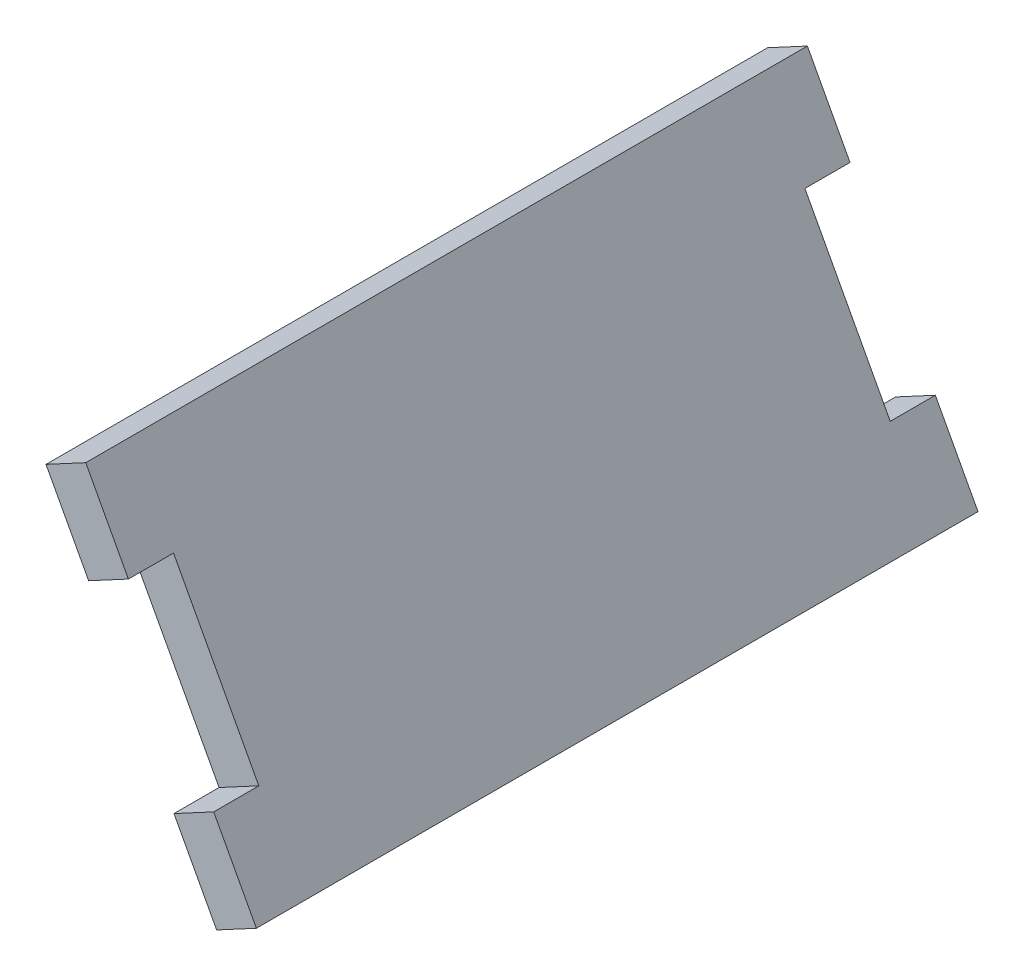
ISO-10303-21;
HEADER;
FILE_DESCRIPTION(('STEP AP214'),'2;1');
FILE_NAME('part.step','',(''),(''),'','','');
FILE_SCHEMA(('AUTOMOTIVE_DESIGN { 1 0 10303 214 1 1 1 1 }'));
ENDSEC;
DATA;
#1=APPLICATION_CONTEXT('core data for automotive mechanical design processes');
#2=APPLICATION_PROTOCOL_DEFINITION('international standard','automotive_design',2000,#1);
#3=PRODUCT_CONTEXT('',#1,'mechanical');
#4=PRODUCT('Part','Part','',(#3));
#5=PRODUCT_RELATED_PRODUCT_CATEGORY('part','',(#4));
#6=PRODUCT_DEFINITION_FORMATION('','',#4);
#7=PRODUCT_DEFINITION_CONTEXT('part definition',#1,'design');
#8=PRODUCT_DEFINITION('design','',#6,#7);
#9=PRODUCT_DEFINITION_SHAPE('','',#8);
#10=(LENGTH_UNIT() NAMED_UNIT(*) SI_UNIT(.MILLI.,.METRE.));
#11=(NAMED_UNIT(*) PLANE_ANGLE_UNIT() SI_UNIT($,.RADIAN.));
#12=(NAMED_UNIT(*) SI_UNIT($,.STERADIAN.) SOLID_ANGLE_UNIT());
#13=UNCERTAINTY_MEASURE_WITH_UNIT(LENGTH_MEASURE(1.E-05),#10,'distance_accuracy_value','');
#14=(GEOMETRIC_REPRESENTATION_CONTEXT(3) GLOBAL_UNCERTAINTY_ASSIGNED_CONTEXT((#13)) GLOBAL_UNIT_ASSIGNED_CONTEXT((#10,
#11,#12)) REPRESENTATION_CONTEXT('',''));
#15=CARTESIAN_POINT('',(0.,0.,0.));
#16=DIRECTION('',(0.,0.,1.));
#17=DIRECTION('',(1.,0.,0.));
#18=AXIS2_PLACEMENT_3D('',#15,#16,#17);
#19=CARTESIAN_POINT('',(0.,0.,-50.8));
#20=DIRECTION('',(0.,0.,-1.));
#21=DIRECTION('',(-1.,0.,0.));
#22=AXIS2_PLACEMENT_3D('',#19,#20,#21);
#23=PLANE('',#22);
#24=DIRECTION('',(0.881120200780153,0.472892368068192,0.));
#25=VECTOR('',#24,1.);
#26=CARTESIAN_POINT('',(149.714088642471,317.155673188776,-50.8));
#27=LINE('',#26,#25);
#28=CARTESIAN_POINT('',(149.714088642471,317.155673188776,-50.8));
#29=VERTEX_POINT('',#28);
#30=CARTESIAN_POINT('',(152.511645279948,318.657106457392,-50.8));
#31=VERTEX_POINT('',#30);
#32=EDGE_CURVE('E153',#29,#31,#27,.T.);
#33=ORIENTED_EDGE('',*,*,#32,.F.);
#34=DIRECTION('',(-0.472892368068192,0.881120200780153,0.));
#35=VECTOR('',#34,1.);
#36=CARTESIAN_POINT('',(158.72268825417,300.370333363914,-50.8));
#37=LINE('',#36,#35);
#38=CARTESIAN_POINT('',(146.711222105238,322.75078646373,-50.8));
#39=VERTEX_POINT('',#38);
#40=EDGE_CURVE('E190',#29,#39,#37,.T.);
#41=ORIENTED_EDGE('',*,*,#40,.T.);
#42=DIRECTION('',(0.881120200780153,0.472892368068192,0.));
#43=VECTOR('',#42,1.);
#44=CARTESIAN_POINT('',(146.711222105238,322.75078646373,-50.8));
#45=LINE('',#44,#43);
#46=CARTESIAN_POINT('',(149.508778742715,324.252219732346,-50.8));
#47=VERTEX_POINT('',#46);
#48=EDGE_CURVE('E180',#39,#47,#45,.T.);
#49=ORIENTED_EDGE('',*,*,#48,.T.);
#50=DIRECTION('',(0.472892368068192,-0.881120200780153,0.));
#51=VECTOR('',#50,1.);
#52=CARTESIAN_POINT('',(149.508778742715,324.252219732346,-50.8));
#53=LINE('',#52,#51);
#54=EDGE_CURVE('E185',#47,#31,#53,.T.);
#55=ORIENTED_EDGE('',*,*,#54,.T.);
#56=EDGE_LOOP('',(#33,#41,#49,#55));
#57=FACE_BOUND('',#56,.T.);
#58=ADVANCED_FACE('F33',(#57),#23,.T.);
#59=CARTESIAN_POINT('',(0.,0.,0.));
#60=DIRECTION('',(0.,0.,-1.));
#61=DIRECTION('',(-1.,0.,0.));
#62=AXIS2_PLACEMENT_3D('',#59,#60,#61);
#63=PLANE('',#62);
#64=DIRECTION('',(-0.472892368068192,0.881120200780153,0.));
#65=VECTOR('',#64,1.);
#66=CARTESIAN_POINT('',(158.72268825417,300.370333363914,0.));
#67=LINE('',#66,#65);
#68=CARTESIAN_POINT('',(149.714088642471,317.155673188776,0.));
#69=VERTEX_POINT('',#68);
#70=CARTESIAN_POINT('',(146.711222105238,322.75078646373,0.));
#71=VERTEX_POINT('',#70);
#72=EDGE_CURVE('E202',#69,#71,#67,.T.);
#73=ORIENTED_EDGE('',*,*,#72,.F.);
#74=DIRECTION('',(0.881120200780153,0.472892368068192,0.));
#75=VECTOR('',#74,1.);
#76=CARTESIAN_POINT('',(149.714088642471,317.155673188776,0.));
#77=LINE('',#76,#75);
#78=CARTESIAN_POINT('',(152.511645279948,318.657106457392,0.));
#79=VERTEX_POINT('',#78);
#80=EDGE_CURVE('E171',#69,#79,#77,.T.);
#81=ORIENTED_EDGE('',*,*,#80,.T.);
#82=DIRECTION('',(0.472892368068192,-0.881120200780153,0.));
#83=VECTOR('',#82,1.);
#84=CARTESIAN_POINT('',(149.508778742715,324.252219732346,0.));
#85=LINE('',#84,#83);
#86=CARTESIAN_POINT('',(149.508778742715,324.252219732346,0.));
#87=VERTEX_POINT('',#86);
#88=EDGE_CURVE('E197',#87,#79,#85,.T.);
#89=ORIENTED_EDGE('',*,*,#88,.F.);
#90=DIRECTION('',(0.881120200780153,0.472892368068192,0.));
#91=VECTOR('',#90,1.);
#92=CARTESIAN_POINT('',(146.711222105238,322.75078646373,0.));
#93=LINE('',#92,#91);
#94=EDGE_CURVE('E174',#71,#87,#93,.T.);
#95=ORIENTED_EDGE('',*,*,#94,.F.);
#96=EDGE_LOOP('',(#73,#81,#89,#95));
#97=FACE_BOUND('',#96,.T.);
#98=ADVANCED_FACE('F238',(#97),#63,.F.);
#99=CARTESIAN_POINT('',(146.711222105238,322.75078646373,-50.8));
#100=DIRECTION('',(0.472892368068192,-0.881120200780153,0.));
#101=DIRECTION('',(0.881120200780153,0.472892368068192,0.));
#102=AXIS2_PLACEMENT_3D('',#99,#100,#101);
#103=PLANE('',#102);
#104=ORIENTED_EDGE('',*,*,#94,.T.);
#105=DIRECTION('',(0.,0.,1.));
#106=VECTOR('',#105,1.);
#107=CARTESIAN_POINT('',(149.508778742715,324.252219732346,-50.8));
#108=LINE('',#107,#106);
#109=EDGE_CURVE('E11',#47,#87,#108,.T.);
#110=ORIENTED_EDGE('',*,*,#109,.F.);
#111=ORIENTED_EDGE('',*,*,#48,.F.);
#112=DIRECTION('',(0.,0.,1.));
#113=VECTOR('',#112,1.);
#114=CARTESIAN_POINT('',(146.711222105238,322.75078646373,-50.8));
#115=LINE('',#114,#113);
#116=EDGE_CURVE('E193',#39,#71,#115,.T.);
#117=ORIENTED_EDGE('',*,*,#116,.T.);
#118=EDGE_LOOP('',(#104,#110,#111,#117));
#119=FACE_BOUND('',#118,.T.);
#120=ADVANCED_FACE('F35',(#119),#103,.F.);
#121=CARTESIAN_POINT('',(149.508778742715,324.252219732346,-50.8));
#122=DIRECTION('',(-0.881120200780153,-0.472892368068192,0.));
#123=DIRECTION('',(0.472892368068192,-0.881120200780153,0.));
#124=AXIS2_PLACEMENT_3D('',#121,#122,#123);
#125=PLANE('',#124);
#126=DIRECTION('',(0.472892368068192,-0.881120200780153,0.));
#127=VECTOR('',#126,1.);
#128=CARTESIAN_POINT('',(158.517378354414,307.466879907484,-47.625));
#129=LINE('',#128,#127);
#130=CARTESIAN_POINT('',(152.511645279948,318.657106457392,-47.625));
#131=VERTEX_POINT('',#130);
#132=CARTESIAN_POINT('',(158.517378354414,307.466879907484,-47.625));
#133=VERTEX_POINT('',#132);
#134=EDGE_CURVE('E129',#131,#133,#129,.T.);
#135=ORIENTED_EDGE('',*,*,#134,.F.);
#136=DIRECTION('',(0.,0.,1.));
#137=VECTOR('',#136,1.);
#138=CARTESIAN_POINT('',(152.511645279948,318.657106457392,-47.625));
#139=LINE('',#138,#137);
#140=EDGE_CURVE('E142',#31,#131,#139,.T.);
#141=ORIENTED_EDGE('',*,*,#140,.F.);
#142=ORIENTED_EDGE('',*,*,#54,.F.);
#143=ORIENTED_EDGE('',*,*,#109,.T.);
#144=ORIENTED_EDGE('',*,*,#88,.T.);
#145=DIRECTION('',(0.,0.,1.));
#146=VECTOR('',#145,1.);
#147=CARTESIAN_POINT('',(152.511645279948,318.657106457392,0.));
#148=LINE('',#147,#146);
#149=CARTESIAN_POINT('',(152.511645279948,318.657106457392,-3.17499999999998));
#150=VERTEX_POINT('',#149);
#151=EDGE_CURVE('E158',#150,#79,#148,.T.);
#152=ORIENTED_EDGE('',*,*,#151,.F.);
#153=DIRECTION('',(-0.472892368068192,0.881120200780153,0.));
#154=VECTOR('',#153,1.);
#155=CARTESIAN_POINT('',(152.511645279948,318.657106457392,-3.17499999999998));
#156=LINE('',#155,#154);
#157=CARTESIAN_POINT('',(158.517378354414,307.466879907484,-3.17499999999998));
#158=VERTEX_POINT('',#157);
#159=EDGE_CURVE('E167',#158,#150,#156,.T.);
#160=ORIENTED_EDGE('',*,*,#159,.F.);
#161=DIRECTION('',(0.,0.,-1.));
#162=VECTOR('',#161,1.);
#163=CARTESIAN_POINT('',(158.517378354414,307.466879907484,0.));
#164=LINE('',#163,#162);
#165=CARTESIAN_POINT('',(158.517378354414,307.466879907484,0.));
#166=VERTEX_POINT('',#165);
#167=EDGE_CURVE('E152',#166,#158,#164,.T.);
#168=ORIENTED_EDGE('',*,*,#167,.F.);
#169=CARTESIAN_POINT('',(161.520244891647,301.87176663253,0.));
#170=VERTEX_POINT('',#169);
#171=EDGE_CURVE('E196',#166,#170,#85,.T.);
#172=ORIENTED_EDGE('',*,*,#171,.T.);
#173=DIRECTION('',(0.,0.,1.));
#174=VECTOR('',#173,1.);
#175=CARTESIAN_POINT('',(161.520244891647,301.87176663253,-50.8));
#176=LINE('',#175,#174);
#177=CARTESIAN_POINT('',(161.520244891647,301.87176663253,-50.8));
#178=VERTEX_POINT('',#177);
#179=EDGE_CURVE('E41',#178,#170,#176,.T.);
#180=ORIENTED_EDGE('',*,*,#179,.F.);
#181=CARTESIAN_POINT('',(158.517378354414,307.466879907484,-50.8));
#182=VERTEX_POINT('',#181);
#183=EDGE_CURVE('E183',#182,#178,#53,.T.);
#184=ORIENTED_EDGE('',*,*,#183,.F.);
#185=DIRECTION('',(0.,0.,-1.));
#186=VECTOR('',#185,1.);
#187=CARTESIAN_POINT('',(158.517378354414,307.466879907484,-47.625));
#188=LINE('',#187,#186);
#189=EDGE_CURVE('E48',#133,#182,#188,.T.);
#190=ORIENTED_EDGE('',*,*,#189,.F.);
#191=EDGE_LOOP('',(#135,#141,#142,#143,#144,#152,#160,#168,#172,#180,#184,#190));
#192=FACE_BOUND('',#191,.T.);
#193=ADVANCED_FACE('F224',(#192),#125,.F.);
#194=CARTESIAN_POINT('',(161.520244891647,301.87176663253,-50.8));
#195=DIRECTION('',(-0.472892368068175,0.881120200780163,0.));
#196=DIRECTION('',(-0.881120200780163,-0.472892368068175,0.));
#197=AXIS2_PLACEMENT_3D('',#194,#195,#196);
#198=PLANE('',#197);
#199=DIRECTION('',(-0.881120200780162,-0.472892368068175,0.));
#200=VECTOR('',#199,1.);
#201=CARTESIAN_POINT('',(161.520244891647,301.87176663253,0.));
#202=LINE('',#201,#200);
#203=CARTESIAN_POINT('',(158.72268825417,300.370333363914,0.));
#204=VERTEX_POINT('',#203);
#205=EDGE_CURVE('E200',#170,#204,#202,.T.);
#206=ORIENTED_EDGE('',*,*,#205,.T.);
#207=DIRECTION('',(0.,0.,1.));
#208=VECTOR('',#207,1.);
#209=CARTESIAN_POINT('',(158.72268825417,300.370333363914,-50.8));
#210=LINE('',#209,#208);
#211=CARTESIAN_POINT('',(158.72268825417,300.370333363914,-50.8));
#212=VERTEX_POINT('',#211);
#213=EDGE_CURVE('E207',#212,#204,#210,.T.);
#214=ORIENTED_EDGE('',*,*,#213,.F.);
#215=DIRECTION('',(-0.881120200780162,-0.472892368068175,0.));
#216=VECTOR('',#215,1.);
#217=CARTESIAN_POINT('',(161.520244891647,301.87176663253,-50.8));
#218=LINE('',#217,#216);
#219=EDGE_CURVE('E188',#178,#212,#218,.T.);
#220=ORIENTED_EDGE('',*,*,#219,.F.);
#221=ORIENTED_EDGE('',*,*,#179,.T.);
#222=EDGE_LOOP('',(#206,#214,#220,#221));
#223=FACE_BOUND('',#222,.T.);
#224=ADVANCED_FACE('F214',(#223),#198,.F.);
#225=CARTESIAN_POINT('',(158.72268825417,300.370333363914,-50.8));
#226=DIRECTION('',(0.881120200780153,0.472892368068192,0.));
#227=DIRECTION('',(-0.472892368068192,0.881120200780153,0.));
#228=AXIS2_PLACEMENT_3D('',#225,#226,#227);
#229=PLANE('',#228);
#230=ORIENTED_EDGE('',*,*,#40,.F.);
#231=DIRECTION('',(0.,0.,1.));
#232=VECTOR('',#231,1.);
#233=CARTESIAN_POINT('',(149.714088642471,317.155673188776,-47.625));
#234=LINE('',#233,#232);
#235=CARTESIAN_POINT('',(149.714088642471,317.155673188776,-47.625));
#236=VERTEX_POINT('',#235);
#237=EDGE_CURVE('E131',#29,#236,#234,.T.);
#238=ORIENTED_EDGE('',*,*,#237,.T.);
#239=DIRECTION('',(0.472892368068192,-0.881120200780153,0.));
#240=VECTOR('',#239,1.);
#241=CARTESIAN_POINT('',(155.719821716937,305.965446638868,-47.625));
#242=LINE('',#241,#240);
#243=CARTESIAN_POINT('',(155.719821716937,305.965446638868,-47.625));
#244=VERTEX_POINT('',#243);
#245=EDGE_CURVE('E126',#236,#244,#242,.T.);
#246=ORIENTED_EDGE('',*,*,#245,.T.);
#247=DIRECTION('',(0.,0.,-1.));
#248=VECTOR('',#247,1.);
#249=CARTESIAN_POINT('',(155.719821716937,305.965446638868,-47.625));
#250=LINE('',#249,#248);
#251=CARTESIAN_POINT('',(155.719821716937,305.965446638868,-50.8));
#252=VERTEX_POINT('',#251);
#253=EDGE_CURVE('E134',#244,#252,#250,.T.);
#254=ORIENTED_EDGE('',*,*,#253,.T.);
#255=EDGE_CURVE('E191',#212,#252,#37,.T.);
#256=ORIENTED_EDGE('',*,*,#255,.F.);
#257=ORIENTED_EDGE('',*,*,#213,.T.);
#258=CARTESIAN_POINT('',(155.719821716937,305.965446638868,0.));
#259=VERTEX_POINT('',#258);
#260=EDGE_CURVE('E184',#204,#259,#67,.T.);
#261=ORIENTED_EDGE('',*,*,#260,.T.);
#262=DIRECTION('',(0.,0.,-1.));
#263=VECTOR('',#262,1.);
#264=CARTESIAN_POINT('',(155.719821716937,305.965446638868,0.));
#265=LINE('',#264,#263);
#266=CARTESIAN_POINT('',(155.719821716937,305.965446638868,-3.17499999999998));
#267=VERTEX_POINT('',#266);
#268=EDGE_CURVE('E56',#259,#267,#265,.T.);
#269=ORIENTED_EDGE('',*,*,#268,.T.);
#270=DIRECTION('',(-0.472892368068192,0.881120200780153,0.));
#271=VECTOR('',#270,1.);
#272=CARTESIAN_POINT('',(149.714088642471,317.155673188776,-3.17499999999998));
#273=LINE('',#272,#271);
#274=CARTESIAN_POINT('',(149.714088642471,317.155673188776,-3.17499999999998));
#275=VERTEX_POINT('',#274);
#276=EDGE_CURVE('E157',#267,#275,#273,.T.);
#277=ORIENTED_EDGE('',*,*,#276,.T.);
#278=DIRECTION('',(0.,0.,1.));
#279=VECTOR('',#278,1.);
#280=CARTESIAN_POINT('',(149.714088642471,317.155673188776,0.));
#281=LINE('',#280,#279);
#282=EDGE_CURVE('E161',#275,#69,#281,.T.);
#283=ORIENTED_EDGE('',*,*,#282,.T.);
#284=ORIENTED_EDGE('',*,*,#72,.T.);
#285=ORIENTED_EDGE('',*,*,#116,.F.);
#286=EDGE_LOOP('',(#230,#238,#246,#254,#256,#257,#261,#269,#277,#283,#284,#285));
#287=FACE_BOUND('',#286,.T.);
#288=ADVANCED_FACE('F141',(#287),#229,.F.);
#289=DIRECTION('',(0.881120200780153,0.472892368068192,0.));
#290=VECTOR('',#289,1.);
#291=CARTESIAN_POINT('',(155.719821716937,305.965446638868,-50.8));
#292=LINE('',#291,#290);
#293=EDGE_CURVE('E130',#252,#182,#292,.T.);
#294=ORIENTED_EDGE('',*,*,#293,.T.);
#295=ORIENTED_EDGE('',*,*,#183,.T.);
#296=ORIENTED_EDGE('',*,*,#219,.T.);
#297=ORIENTED_EDGE('',*,*,#255,.T.);
#298=EDGE_LOOP('',(#294,#295,#296,#297));
#299=FACE_BOUND('',#298,.T.);
#300=ADVANCED_FACE('F223',(#299),#23,.T.);
#301=ORIENTED_EDGE('',*,*,#171,.F.);
#302=DIRECTION('',(0.881120200780153,0.472892368068192,0.));
#303=VECTOR('',#302,1.);
#304=CARTESIAN_POINT('',(155.719821716937,305.965446638868,0.));
#305=LINE('',#304,#303);
#306=EDGE_CURVE('E164',#259,#166,#305,.T.);
#307=ORIENTED_EDGE('',*,*,#306,.F.);
#308=ORIENTED_EDGE('',*,*,#260,.F.);
#309=ORIENTED_EDGE('',*,*,#205,.F.);
#310=EDGE_LOOP('',(#301,#307,#308,#309));
#311=FACE_BOUND('',#310,.T.);
#312=ADVANCED_FACE('F221',(#311),#63,.F.);
#313=CARTESIAN_POINT('',(149.714088642471,317.155673188776,0.));
#314=DIRECTION('',(-0.472892368068192,0.881120200780153,0.));
#315=DIRECTION('',(-0.881120200780153,-0.472892368068192,0.));
#316=AXIS2_PLACEMENT_3D('',#313,#314,#315);
#317=PLANE('',#316);
#318=ORIENTED_EDGE('',*,*,#151,.T.);
#319=ORIENTED_EDGE('',*,*,#80,.F.);
#320=ORIENTED_EDGE('',*,*,#282,.F.);
#321=DIRECTION('',(0.881120200780153,0.472892368068192,0.));
#322=VECTOR('',#321,1.);
#323=CARTESIAN_POINT('',(149.714088642471,317.155673188776,-3.17499999999998));
#324=LINE('',#323,#322);
#325=EDGE_CURVE('E175',#275,#150,#324,.T.);
#326=ORIENTED_EDGE('',*,*,#325,.T.);
#327=EDGE_LOOP('',(#318,#319,#320,#326));
#328=FACE_BOUND('',#327,.T.);
#329=ADVANCED_FACE('F241',(#328),#317,.F.);
#330=CARTESIAN_POINT('',(149.714088642471,317.155673188776,-3.17499999999998));
#331=DIRECTION('',(0.,0.,-1.));
#332=DIRECTION('',(0.,1.,0.));
#333=AXIS2_PLACEMENT_3D('',#330,#331,#332);
#334=PLANE('',#333);
#335=ORIENTED_EDGE('',*,*,#159,.T.);
#336=ORIENTED_EDGE('',*,*,#325,.F.);
#337=ORIENTED_EDGE('',*,*,#276,.F.);
#338=DIRECTION('',(0.881120200780153,0.472892368068192,0.));
#339=VECTOR('',#338,1.);
#340=CARTESIAN_POINT('',(155.719821716937,305.965446638868,-3.17499999999998));
#341=LINE('',#340,#339);
#342=EDGE_CURVE('E177',#267,#158,#341,.T.);
#343=ORIENTED_EDGE('',*,*,#342,.T.);
#344=EDGE_LOOP('',(#335,#336,#337,#343));
#345=FACE_BOUND('',#344,.T.);
#346=ADVANCED_FACE('F244',(#345),#334,.F.);
#347=CARTESIAN_POINT('',(155.719821716937,305.965446638868,0.));
#348=DIRECTION('',(0.472892368068192,-0.881120200780153,0.));
#349=DIRECTION('',(0.881120200780153,0.472892368068192,0.));
#350=AXIS2_PLACEMENT_3D('',#347,#348,#349);
#351=PLANE('',#350);
#352=ORIENTED_EDGE('',*,*,#167,.T.);
#353=ORIENTED_EDGE('',*,*,#342,.F.);
#354=ORIENTED_EDGE('',*,*,#268,.F.);
#355=ORIENTED_EDGE('',*,*,#306,.T.);
#356=EDGE_LOOP('',(#352,#353,#354,#355));
#357=FACE_BOUND('',#356,.T.);
#358=ADVANCED_FACE('F246',(#357),#351,.F.);
#359=CARTESIAN_POINT('',(155.719821716937,305.965446638868,-47.625));
#360=DIRECTION('',(0.,0.,1.));
#361=DIRECTION('',(1.,0.,0.));
#362=AXIS2_PLACEMENT_3D('',#359,#360,#361);
#363=PLANE('',#362);
#364=ORIENTED_EDGE('',*,*,#134,.T.);
#365=DIRECTION('',(0.881120200780153,0.472892368068192,0.));
#366=VECTOR('',#365,1.);
#367=CARTESIAN_POINT('',(155.719821716937,305.965446638868,-47.625));
#368=LINE('',#367,#366);
#369=EDGE_CURVE('E122',#244,#133,#368,.T.);
#370=ORIENTED_EDGE('',*,*,#369,.F.);
#371=ORIENTED_EDGE('',*,*,#245,.F.);
#372=DIRECTION('',(0.881120200780153,0.472892368068192,0.));
#373=VECTOR('',#372,1.);
#374=CARTESIAN_POINT('',(149.714088642471,317.155673188776,-47.625));
#375=LINE('',#374,#373);
#376=EDGE_CURVE('E150',#236,#131,#375,.T.);
#377=ORIENTED_EDGE('',*,*,#376,.T.);
#378=EDGE_LOOP('',(#364,#370,#371,#377));
#379=FACE_BOUND('',#378,.T.);
#380=ADVANCED_FACE('F124',(#379),#363,.F.);
#381=CARTESIAN_POINT('',(149.714088642471,317.155673188776,-47.625));
#382=DIRECTION('',(-0.472892368068192,0.881120200780153,0.));
#383=DIRECTION('',(-0.881120200780153,-0.472892368068192,0.));
#384=AXIS2_PLACEMENT_3D('',#381,#382,#383);
#385=PLANE('',#384);
#386=ORIENTED_EDGE('',*,*,#140,.T.);
#387=ORIENTED_EDGE('',*,*,#376,.F.);
#388=ORIENTED_EDGE('',*,*,#237,.F.);
#389=ORIENTED_EDGE('',*,*,#32,.T.);
#390=EDGE_LOOP('',(#386,#387,#388,#389));
#391=FACE_BOUND('',#390,.T.);
#392=ADVANCED_FACE('F253',(#391),#385,.F.);
#393=CARTESIAN_POINT('',(155.719821716937,305.965446638868,-47.625));
#394=DIRECTION('',(0.472892368068192,-0.881120200780153,0.));
#395=DIRECTION('',(0.881120200780153,0.472892368068192,0.));
#396=AXIS2_PLACEMENT_3D('',#393,#394,#395);
#397=PLANE('',#396);
#398=ORIENTED_EDGE('',*,*,#189,.T.);
#399=ORIENTED_EDGE('',*,*,#293,.F.);
#400=ORIENTED_EDGE('',*,*,#253,.F.);
#401=ORIENTED_EDGE('',*,*,#369,.T.);
#402=EDGE_LOOP('',(#398,#399,#400,#401));
#403=FACE_BOUND('',#402,.T.);
#404=ADVANCED_FACE('F135',(#403),#397,.F.);
#405=CLOSED_SHELL('',(#58,#98,#120,#193,#224,#288,#300,#312,#329,#346,#358,#380,#392,#404));
#406=MANIFOLD_SOLID_BREP('B2',#405);
#407=ADVANCED_BREP_SHAPE_REPRESENTATION('',(#18,#406),#14);
#408=SHAPE_DEFINITION_REPRESENTATION(#9,#407);
ENDSEC;
END-ISO-10303-21;
